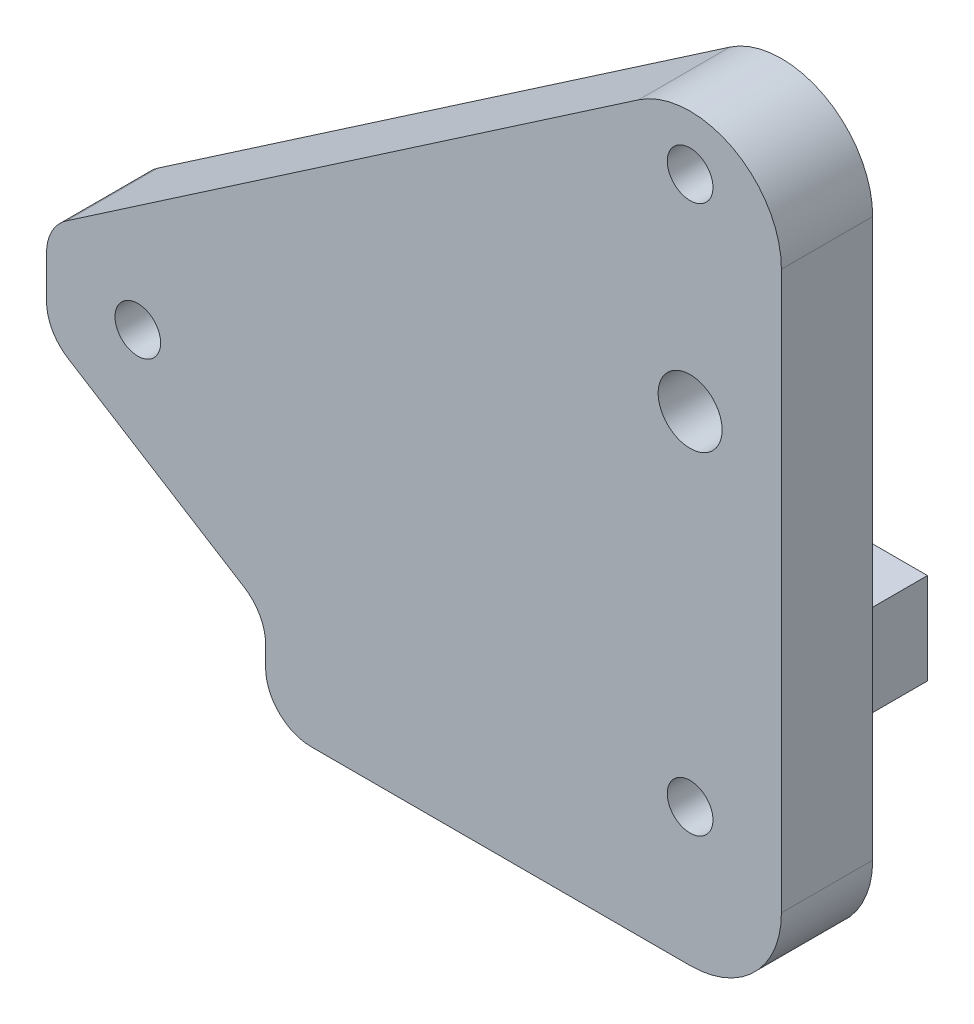
ISO-10303-21;
HEADER;
FILE_DESCRIPTION(('STEP AP214'),'2;1');
FILE_NAME('part.step','',(''),(''),'','','');
FILE_SCHEMA(('AUTOMOTIVE_DESIGN { 1 0 10303 214 1 1 1 1 }'));
ENDSEC;
DATA;
#1=APPLICATION_CONTEXT('core data for automotive mechanical design processes');
#2=APPLICATION_PROTOCOL_DEFINITION('international standard','automotive_design',2000,#1);
#3=PRODUCT_CONTEXT('',#1,'mechanical');
#4=PRODUCT('Part','Part','',(#3));
#5=PRODUCT_RELATED_PRODUCT_CATEGORY('part','',(#4));
#6=PRODUCT_DEFINITION_FORMATION('','',#4);
#7=PRODUCT_DEFINITION_CONTEXT('part definition',#1,'design');
#8=PRODUCT_DEFINITION('design','',#6,#7);
#9=PRODUCT_DEFINITION_SHAPE('','',#8);
#10=(LENGTH_UNIT() NAMED_UNIT(*) SI_UNIT(.MILLI.,.METRE.));
#11=(NAMED_UNIT(*) PLANE_ANGLE_UNIT() SI_UNIT($,.RADIAN.));
#12=(NAMED_UNIT(*) SI_UNIT($,.STERADIAN.) SOLID_ANGLE_UNIT());
#13=UNCERTAINTY_MEASURE_WITH_UNIT(LENGTH_MEASURE(1.E-05),#10,'distance_accuracy_value','');
#14=(GEOMETRIC_REPRESENTATION_CONTEXT(3) GLOBAL_UNCERTAINTY_ASSIGNED_CONTEXT((#13)) GLOBAL_UNIT_ASSIGNED_CONTEXT((#10,
#11,#12)) REPRESENTATION_CONTEXT('',''));
#15=CARTESIAN_POINT('',(0.,0.,0.));
#16=DIRECTION('',(0.,0.,1.));
#17=DIRECTION('',(1.,0.,0.));
#18=AXIS2_PLACEMENT_3D('',#15,#16,#17);
#19=CARTESIAN_POINT('',(-61.5,-45.3371408001229,10.));
#20=DIRECTION('',(0.,0.,1.));
#21=DIRECTION('',(1.,0.,0.));
#22=AXIS2_PLACEMENT_3D('',#19,#20,#21);
#23=PLANE('',#22);
#24=CARTESIAN_POINT('',(-9.99999999999999,0.,10.));
#25=DIRECTION('',(0.,0.,1.));
#26=DIRECTION('',(1.,0.,0.));
#27=AXIS2_PLACEMENT_3D('',#24,#25,#26);
#28=CIRCLE('',#27,3.5);
#29=CARTESIAN_POINT('',(-6.5,0.,10.));
#30=VERTEX_POINT('',#29);
#31=EDGE_CURVE('E344',#30,#30,#28,.T.);
#32=ORIENTED_EDGE('',*,*,#31,.F.);
#33=EDGE_LOOP('',(#32));
#34=FACE_BOUND('',#33,.T.);
#35=CARTESIAN_POINT('',(-70.5,-22.5,10.));
#36=DIRECTION('',(0.,0.,1.));
#37=DIRECTION('',(1.,0.,0.));
#38=AXIS2_PLACEMENT_3D('',#35,#36,#37);
#39=CIRCLE('',#38,2.5);
#40=CARTESIAN_POINT('',(-68.,-22.5,10.));
#41=VERTEX_POINT('',#40);
#42=EDGE_CURVE('E356',#41,#41,#39,.T.);
#43=ORIENTED_EDGE('',*,*,#42,.F.);
#44=EDGE_LOOP('',(#43));
#45=FACE_BOUND('',#44,.T.);
#46=CARTESIAN_POINT('',(-61.5,-45.3371408001229,10.));
#47=DIRECTION('',(0.,0.,1.));
#48=DIRECTION('',(1.,0.,0.));
#49=AXIS2_PLACEMENT_3D('',#46,#47,#48);
#50=CIRCLE('',#49,5.);
#51=CARTESIAN_POINT('',(-56.5,-45.337140800123,10.));
#52=VERTEX_POINT('',#51);
#53=CARTESIAN_POINT('',(-58.8500052999841,-41.0971492800975,10.));
#54=VERTEX_POINT('',#53);
#55=EDGE_CURVE('E362',#52,#54,#50,.T.);
#56=ORIENTED_EDGE('',*,*,#55,.F.);
#57=DIRECTION('',(0.,1.,0.));
#58=VECTOR('',#57,1.);
#59=CARTESIAN_POINT('',(-56.5,-47.5659025925876,10.));
#60=LINE('',#59,#58);
#61=CARTESIAN_POINT('',(-56.5,-47.5659025925876,10.));
#62=VERTEX_POINT('',#61);
#63=EDGE_CURVE('E392',#62,#52,#60,.T.);
#64=ORIENTED_EDGE('',*,*,#63,.F.);
#65=CARTESIAN_POINT('',(-51.5,-47.5659025925876,10.));
#66=DIRECTION('',(0.,0.,-1.));
#67=DIRECTION('',(-1.,0.,0.));
#68=AXIS2_PLACEMENT_3D('',#65,#66,#67);
#69=CIRCLE('',#68,5.);
#70=CARTESIAN_POINT('',(-51.5,-52.5659025925876,10.));
#71=VERTEX_POINT('',#70);
#72=EDGE_CURVE('E389',#71,#62,#69,.T.);
#73=ORIENTED_EDGE('',*,*,#72,.F.);
#74=DIRECTION('',(-1.,0.,0.));
#75=VECTOR('',#74,1.);
#76=CARTESIAN_POINT('',(-9.99999999999999,-52.5659025925875,10.));
#77=LINE('',#76,#75);
#78=CARTESIAN_POINT('',(-9.99999999999998,-52.5659025925875,10.));
#79=VERTEX_POINT('',#78);
#80=EDGE_CURVE('E386',#79,#71,#77,.T.);
#81=ORIENTED_EDGE('',*,*,#80,.F.);
#82=CARTESIAN_POINT('',(-9.99999999999999,-42.5659025925875,10.));
#83=DIRECTION('',(0.,0.,-1.));
#84=DIRECTION('',(-1.,0.,0.));
#85=AXIS2_PLACEMENT_3D('',#82,#83,#84);
#86=CIRCLE('',#85,10.);
#87=CARTESIAN_POINT('',(0.,-42.5659025925875,10.));
#88=VERTEX_POINT('',#87);
#89=EDGE_CURVE('E383',#88,#79,#86,.T.);
#90=ORIENTED_EDGE('',*,*,#89,.F.);
#91=DIRECTION('',(0.,-1.,0.));
#92=VECTOR('',#91,1.);
#93=CARTESIAN_POINT('',(0.,18.4906350894,10.));
#94=LINE('',#93,#92);
#95=CARTESIAN_POINT('',(0.,18.4906350894,10.));
#96=VERTEX_POINT('',#95);
#97=EDGE_CURVE('E380',#96,#88,#94,.T.);
#98=ORIENTED_EDGE('',*,*,#97,.F.);
#99=CARTESIAN_POINT('',(-10.,18.4906350894,10.));
#100=DIRECTION('',(0.,0.,1.));
#101=DIRECTION('',(1.,0.,0.));
#102=AXIS2_PLACEMENT_3D('',#99,#100,#101);
#103=CIRCLE('',#102,10.);
#104=CARTESIAN_POINT('',(-15.6413223653245,26.7474796422839,10.));
#105=VERTEX_POINT('',#104);
#106=EDGE_CURVE('E378',#96,#105,#103,.T.);
#107=ORIENTED_EDGE('',*,*,#106,.T.);
#108=DIRECTION('',(-0.825684455288399,-0.564132236532446,0.));
#109=VECTOR('',#108,1.);
#110=CARTESIAN_POINT('',(-15.6413223653245,26.7474796422839,10.));
#111=LINE('',#110,#109);
#112=CARTESIAN_POINT('',(-78.3206611826622,-16.0769133385059,10.));
#113=VERTEX_POINT('',#112);
#114=EDGE_CURVE('E376',#105,#113,#111,.T.);
#115=ORIENTED_EDGE('',*,*,#114,.T.);
#116=CARTESIAN_POINT('',(-75.5,-20.2053356149478,10.));
#117=DIRECTION('',(0.,0.,-1.));
#118=DIRECTION('',(-1.,0.,0.));
#119=AXIS2_PLACEMENT_3D('',#116,#117,#118);
#120=CIRCLE('',#119,4.99999999999998);
#121=CARTESIAN_POINT('',(-80.5,-20.2053356149478,10.));
#122=VERTEX_POINT('',#121);
#123=EDGE_CURVE('E373',#122,#113,#120,.T.);
#124=ORIENTED_EDGE('',*,*,#123,.F.);
#125=DIRECTION('',(0.,-1.,0.));
#126=VECTOR('',#125,1.);
#127=CARTESIAN_POINT('',(-80.5,-20.2053356149478,10.));
#128=LINE('',#127,#126);
#129=CARTESIAN_POINT('',(-80.5,-24.7946643850522,10.));
#130=VERTEX_POINT('',#129);
#131=EDGE_CURVE('E371',#122,#130,#128,.T.);
#132=ORIENTED_EDGE('',*,*,#131,.T.);
#133=CARTESIAN_POINT('',(-75.5,-24.7946643850522,10.));
#134=DIRECTION('',(0.,0.,1.));
#135=DIRECTION('',(1.,0.,0.));
#136=AXIS2_PLACEMENT_3D('',#133,#134,#135);
#137=CIRCLE('',#136,5.);
#138=CARTESIAN_POINT('',(-78.1499947000159,-29.0346559050776,10.));
#139=VERTEX_POINT('',#138);
#140=EDGE_CURVE('E369',#130,#139,#137,.T.);
#141=ORIENTED_EDGE('',*,*,#140,.T.);
#142=DIRECTION('',(-0.847998304005088,0.529998940003179,0.));
#143=VECTOR('',#142,1.);
#144=CARTESIAN_POINT('',(-58.8500052999841,-41.0971492800975,10.));
#145=LINE('',#144,#143);
#146=EDGE_CURVE('E365',#54,#139,#145,.T.);
#147=ORIENTED_EDGE('',*,*,#146,.F.);
#148=EDGE_LOOP('',(#56,#64,#73,#81,#90,#98,#107,#115,#124,#132,#141,#147));
#149=FACE_BOUND('',#148,.T.);
#150=CARTESIAN_POINT('',(-9.99999999999999,-37.5,10.));
#151=DIRECTION('',(0.,0.,1.));
#152=DIRECTION('',(1.,0.,0.));
#153=AXIS2_PLACEMENT_3D('',#150,#151,#152);
#154=CIRCLE('',#153,2.5);
#155=CARTESIAN_POINT('',(-7.49999999999999,-37.5,10.));
#156=VERTEX_POINT('',#155);
#157=EDGE_CURVE('E350',#156,#156,#154,.T.);
#158=ORIENTED_EDGE('',*,*,#157,.F.);
#159=EDGE_LOOP('',(#158));
#160=FACE_BOUND('',#159,.T.);
#161=CARTESIAN_POINT('',(-9.99999999999999,22.5,10.));
#162=DIRECTION('',(0.,0.,1.));
#163=DIRECTION('',(1.,0.,0.));
#164=AXIS2_PLACEMENT_3D('',#161,#162,#163);
#165=CIRCLE('',#164,2.5);
#166=CARTESIAN_POINT('',(-7.49999999999999,22.5,10.));
#167=VERTEX_POINT('',#166);
#168=EDGE_CURVE('E338',#167,#167,#165,.T.);
#169=ORIENTED_EDGE('',*,*,#168,.F.);
#170=EDGE_LOOP('',(#169));
#171=FACE_BOUND('',#170,.T.);
#172=ADVANCED_FACE('F189',(#34,#45,#149,#160,#171),#23,.T.);
#173=CARTESIAN_POINT('',(-61.5,-45.3371408001229,0.));
#174=DIRECTION('',(0.,0.,1.));
#175=DIRECTION('',(1.,0.,0.));
#176=AXIS2_PLACEMENT_3D('',#173,#174,#175);
#177=PLANE('',#176);
#178=DIRECTION('',(-1.,0.,0.));
#179=VECTOR('',#178,1.);
#180=CARTESIAN_POINT('',(-9.99999999999999,-52.5659025925875,0.));
#181=LINE('',#180,#179);
#182=CARTESIAN_POINT('',(-9.99999999999998,-52.5659025925875,0.));
#183=VERTEX_POINT('',#182);
#184=CARTESIAN_POINT('',(-24.,-52.5659025925875,0.));
#185=VERTEX_POINT('',#184);
#186=EDGE_CURVE('E366',#183,#185,#181,.T.);
#187=ORIENTED_EDGE('',*,*,#186,.T.);
#188=DIRECTION('',(0.,1.,0.));
#189=VECTOR('',#188,1.);
#190=CARTESIAN_POINT('',(-24.,-52.5659025925875,0.));
#191=LINE('',#190,#189);
#192=CARTESIAN_POINT('',(-24.,-42.5659025925875,0.));
#193=VERTEX_POINT('',#192);
#194=EDGE_CURVE('E206',#185,#193,#191,.T.);
#195=ORIENTED_EDGE('',*,*,#194,.T.);
#196=DIRECTION('',(-1.,0.,0.));
#197=VECTOR('',#196,1.);
#198=CARTESIAN_POINT('',(-24.,-42.5659025925875,0.));
#199=LINE('',#198,#197);
#200=CARTESIAN_POINT('',(-56.5,-42.5659025925875,0.));
#201=VERTEX_POINT('',#200);
#202=EDGE_CURVE('E211',#193,#201,#199,.T.);
#203=ORIENTED_EDGE('',*,*,#202,.T.);
#204=DIRECTION('',(0.,-1.,0.));
#205=VECTOR('',#204,1.);
#206=CARTESIAN_POINT('',(-56.5,-47.5659025925876,0.));
#207=LINE('',#206,#205);
#208=CARTESIAN_POINT('',(-56.5,-45.3371408001229,0.));
#209=VERTEX_POINT('',#208);
#210=EDGE_CURVE('E320',#201,#209,#207,.T.);
#211=ORIENTED_EDGE('',*,*,#210,.T.);
#212=CARTESIAN_POINT('',(-61.5,-45.3371408001229,0.));
#213=DIRECTION('',(0.,0.,1.));
#214=DIRECTION('',(1.,0.,0.));
#215=AXIS2_PLACEMENT_3D('',#212,#213,#214);
#216=CIRCLE('',#215,5.);
#217=CARTESIAN_POINT('',(-58.8500052999841,-41.0971492800975,0.));
#218=VERTEX_POINT('',#217);
#219=EDGE_CURVE('E359',#209,#218,#216,.T.);
#220=ORIENTED_EDGE('',*,*,#219,.T.);
#221=DIRECTION('',(-0.847998304005088,0.529998940003179,0.));
#222=VECTOR('',#221,1.);
#223=CARTESIAN_POINT('',(-58.8500052999841,-41.0971492800975,0.));
#224=LINE('',#223,#222);
#225=CARTESIAN_POINT('',(-78.1499947000159,-29.0346559050776,0.));
#226=VERTEX_POINT('',#225);
#227=EDGE_CURVE('E397',#218,#226,#224,.T.);
#228=ORIENTED_EDGE('',*,*,#227,.T.);
#229=CARTESIAN_POINT('',(-75.5,-24.7946643850522,0.));
#230=DIRECTION('',(0.,0.,1.));
#231=DIRECTION('',(1.,0.,0.));
#232=AXIS2_PLACEMENT_3D('',#229,#230,#231);
#233=CIRCLE('',#232,5.);
#234=CARTESIAN_POINT('',(-80.5,-24.7946643850522,0.));
#235=VERTEX_POINT('',#234);
#236=EDGE_CURVE('E400',#235,#226,#233,.T.);
#237=ORIENTED_EDGE('',*,*,#236,.F.);
#238=DIRECTION('',(0.,-1.,0.));
#239=VECTOR('',#238,1.);
#240=CARTESIAN_POINT('',(-80.5,-20.2053356149478,0.));
#241=LINE('',#240,#239);
#242=CARTESIAN_POINT('',(-80.5,-20.2053356149478,0.));
#243=VERTEX_POINT('',#242);
#244=EDGE_CURVE('E403',#243,#235,#241,.T.);
#245=ORIENTED_EDGE('',*,*,#244,.F.);
#246=CARTESIAN_POINT('',(-75.5,-20.2053356149478,0.));
#247=DIRECTION('',(0.,0.,-1.));
#248=DIRECTION('',(-1.,0.,0.));
#249=AXIS2_PLACEMENT_3D('',#246,#247,#248);
#250=CIRCLE('',#249,4.99999999999998);
#251=CARTESIAN_POINT('',(-78.3206611826622,-16.0769133385059,0.));
#252=VERTEX_POINT('',#251);
#253=EDGE_CURVE('E405',#243,#252,#250,.T.);
#254=ORIENTED_EDGE('',*,*,#253,.T.);
#255=DIRECTION('',(-0.825684455288399,-0.564132236532446,0.));
#256=VECTOR('',#255,1.);
#257=CARTESIAN_POINT('',(-15.6413223653245,26.7474796422839,0.));
#258=LINE('',#257,#256);
#259=CARTESIAN_POINT('',(-15.6413223653245,26.7474796422839,0.));
#260=VERTEX_POINT('',#259);
#261=EDGE_CURVE('E408',#260,#252,#258,.T.);
#262=ORIENTED_EDGE('',*,*,#261,.F.);
#263=CARTESIAN_POINT('',(-10.,18.4906350894,0.));
#264=DIRECTION('',(0.,0.,1.));
#265=DIRECTION('',(1.,0.,0.));
#266=AXIS2_PLACEMENT_3D('',#263,#264,#265);
#267=CIRCLE('',#266,10.);
#268=CARTESIAN_POINT('',(0.,18.4906350894,0.));
#269=VERTEX_POINT('',#268);
#270=EDGE_CURVE('E411',#269,#260,#267,.T.);
#271=ORIENTED_EDGE('',*,*,#270,.F.);
#272=DIRECTION('',(0.,-1.,0.));
#273=VECTOR('',#272,1.);
#274=CARTESIAN_POINT('',(0.,18.4906350894,0.));
#275=LINE('',#274,#273);
#276=CARTESIAN_POINT('',(0.,-42.5659025925875,0.));
#277=VERTEX_POINT('',#276);
#278=EDGE_CURVE('E413',#269,#277,#275,.T.);
#279=ORIENTED_EDGE('',*,*,#278,.T.);
#280=CARTESIAN_POINT('',(-9.99999999999999,-42.5659025925875,0.));
#281=DIRECTION('',(0.,0.,-1.));
#282=DIRECTION('',(-1.,0.,0.));
#283=AXIS2_PLACEMENT_3D('',#280,#281,#282);
#284=CIRCLE('',#283,10.);
#285=EDGE_CURVE('E416',#277,#183,#284,.T.);
#286=ORIENTED_EDGE('',*,*,#285,.T.);
#287=EDGE_LOOP('',(#187,#195,#203,#211,#220,#228,#237,#245,#254,#262,#271,#279,#286));
#288=FACE_BOUND('',#287,.T.);
#289=CARTESIAN_POINT('',(-70.5,-22.5,0.));
#290=DIRECTION('',(0.,0.,1.));
#291=DIRECTION('',(1.,0.,0.));
#292=AXIS2_PLACEMENT_3D('',#289,#290,#291);
#293=CIRCLE('',#292,2.5);
#294=CARTESIAN_POINT('',(-68.,-22.5,0.));
#295=VERTEX_POINT('',#294);
#296=EDGE_CURVE('E353',#295,#295,#293,.T.);
#297=ORIENTED_EDGE('',*,*,#296,.T.);
#298=EDGE_LOOP('',(#297));
#299=FACE_BOUND('',#298,.T.);
#300=CARTESIAN_POINT('',(-9.99999999999999,-37.5,0.));
#301=DIRECTION('',(0.,0.,1.));
#302=DIRECTION('',(1.,0.,0.));
#303=AXIS2_PLACEMENT_3D('',#300,#301,#302);
#304=CIRCLE('',#303,2.5);
#305=CARTESIAN_POINT('',(-7.49999999999999,-37.5,0.));
#306=VERTEX_POINT('',#305);
#307=EDGE_CURVE('E347',#306,#306,#304,.T.);
#308=ORIENTED_EDGE('',*,*,#307,.T.);
#309=EDGE_LOOP('',(#308));
#310=FACE_BOUND('',#309,.T.);
#311=CARTESIAN_POINT('',(-9.99999999999999,0.,0.));
#312=DIRECTION('',(0.,0.,1.));
#313=DIRECTION('',(1.,0.,0.));
#314=AXIS2_PLACEMENT_3D('',#311,#312,#313);
#315=CIRCLE('',#314,3.5);
#316=CARTESIAN_POINT('',(-6.5,0.,0.));
#317=VERTEX_POINT('',#316);
#318=EDGE_CURVE('E341',#317,#317,#315,.T.);
#319=ORIENTED_EDGE('',*,*,#318,.T.);
#320=EDGE_LOOP('',(#319));
#321=FACE_BOUND('',#320,.T.);
#322=CARTESIAN_POINT('',(-9.99999999999999,22.5,0.));
#323=DIRECTION('',(0.,0.,1.));
#324=DIRECTION('',(1.,0.,0.));
#325=AXIS2_PLACEMENT_3D('',#322,#323,#324);
#326=CIRCLE('',#325,2.5);
#327=CARTESIAN_POINT('',(-7.49999999999999,22.5,0.));
#328=VERTEX_POINT('',#327);
#329=EDGE_CURVE('E336',#328,#328,#326,.T.);
#330=ORIENTED_EDGE('',*,*,#329,.T.);
#331=EDGE_LOOP('',(#330));
#332=FACE_BOUND('',#331,.T.);
#333=ADVANCED_FACE('F447',(#288,#299,#310,#321,#332),#177,.F.);
#334=CARTESIAN_POINT('',(-61.5,-45.3371408001229,10.));
#335=DIRECTION('',(0.,0.,-1.));
#336=DIRECTION('',(-1.,0.,0.));
#337=AXIS2_PLACEMENT_3D('',#334,#335,#336);
#338=CYLINDRICAL_SURFACE('',#337,5.);
#339=ORIENTED_EDGE('',*,*,#219,.F.);
#340=DIRECTION('',(0.,0.,-1.));
#341=VECTOR('',#340,1.);
#342=CARTESIAN_POINT('',(-56.5,-45.337140800123,10.));
#343=LINE('',#342,#341);
#344=EDGE_CURVE('E12',#52,#209,#343,.T.);
#345=ORIENTED_EDGE('',*,*,#344,.F.);
#346=ORIENTED_EDGE('',*,*,#55,.T.);
#347=DIRECTION('',(0.,0.,-1.));
#348=VECTOR('',#347,1.);
#349=CARTESIAN_POINT('',(-58.8500052999841,-41.0971492800975,10.));
#350=LINE('',#349,#348);
#351=EDGE_CURVE('E193',#54,#218,#350,.T.);
#352=ORIENTED_EDGE('',*,*,#351,.T.);
#353=EDGE_LOOP('',(#339,#345,#346,#352));
#354=FACE_BOUND('',#353,.T.);
#355=ADVANCED_FACE('F191',(#354),#338,.F.);
#356=CARTESIAN_POINT('',(-56.5,-47.5659025925876,10.));
#357=DIRECTION('',(-1.,0.,0.));
#358=DIRECTION('',(0.,-1.,0.));
#359=AXIS2_PLACEMENT_3D('',#356,#357,#358);
#360=PLANE('',#359);
#361=ORIENTED_EDGE('',*,*,#344,.T.);
#362=ORIENTED_EDGE('',*,*,#210,.F.);
#363=DIRECTION('',(0.,0.,1.));
#364=VECTOR('',#363,1.);
#365=CARTESIAN_POINT('',(-56.5,-42.5659025925875,-30.));
#366=LINE('',#365,#364);
#367=CARTESIAN_POINT('',(-56.5,-42.5659025925875,-30.));
#368=VERTEX_POINT('',#367);
#369=EDGE_CURVE('E303',#368,#201,#366,.T.);
#370=ORIENTED_EDGE('',*,*,#369,.F.);
#371=DIRECTION('',(0.,-1.,0.));
#372=VECTOR('',#371,1.);
#373=CARTESIAN_POINT('',(-56.5,-47.5659025925876,-30.));
#374=LINE('',#373,#372);
#375=CARTESIAN_POINT('',(-56.5,-47.5659025925876,-30.));
#376=VERTEX_POINT('',#375);
#377=EDGE_CURVE('E315',#368,#376,#374,.T.);
#378=ORIENTED_EDGE('',*,*,#377,.T.);
#379=DIRECTION('',(0.,0.,-1.));
#380=VECTOR('',#379,1.);
#381=CARTESIAN_POINT('',(-56.5,-47.5659025925876,10.));
#382=LINE('',#381,#380);
#383=EDGE_CURVE('E198',#62,#376,#382,.T.);
#384=ORIENTED_EDGE('',*,*,#383,.F.);
#385=ORIENTED_EDGE('',*,*,#63,.T.);
#386=EDGE_LOOP('',(#361,#362,#370,#378,#384,#385));
#387=FACE_BOUND('',#386,.T.);
#388=ADVANCED_FACE('F451',(#387),#360,.T.);
#389=CARTESIAN_POINT('',(-51.5,-47.5659025925876,10.));
#390=DIRECTION('',(0.,0.,-1.));
#391=DIRECTION('',(-1.,0.,0.));
#392=AXIS2_PLACEMENT_3D('',#389,#390,#391);
#393=CYLINDRICAL_SURFACE('',#392,5.);
#394=ORIENTED_EDGE('',*,*,#383,.T.);
#395=CARTESIAN_POINT('',(-51.5,-47.5659025925876,-30.));
#396=DIRECTION('',(0.,0.,1.));
#397=DIRECTION('',(1.,0.,0.));
#398=AXIS2_PLACEMENT_3D('',#395,#396,#397);
#399=CIRCLE('',#398,5.);
#400=CARTESIAN_POINT('',(-51.5,-52.5659025925876,-30.));
#401=VERTEX_POINT('',#400);
#402=EDGE_CURVE('E328',#376,#401,#399,.T.);
#403=ORIENTED_EDGE('',*,*,#402,.T.);
#404=DIRECTION('',(0.,0.,-1.));
#405=VECTOR('',#404,1.);
#406=CARTESIAN_POINT('',(-51.5,-52.5659025925876,10.));
#407=LINE('',#406,#405);
#408=EDGE_CURVE('E421',#71,#401,#407,.T.);
#409=ORIENTED_EDGE('',*,*,#408,.F.);
#410=ORIENTED_EDGE('',*,*,#72,.T.);
#411=EDGE_LOOP('',(#394,#403,#409,#410));
#412=FACE_BOUND('',#411,.T.);
#413=ADVANCED_FACE('F488',(#412),#393,.T.);
#414=CARTESIAN_POINT('',(-9.99999999999999,-52.5659025925875,10.));
#415=DIRECTION('',(0.,-1.,0.));
#416=DIRECTION('',(1.,0.,0.));
#417=AXIS2_PLACEMENT_3D('',#414,#415,#416);
#418=PLANE('',#417);
#419=CARTESIAN_POINT('',(-40.25,-52.5659025925876,-23.));
#420=DIRECTION('',(0.,1.,0.));
#421=DIRECTION('',(-1.,0.,0.));
#422=AXIS2_PLACEMENT_3D('',#419,#420,#421);
#423=CIRCLE('',#422,1.75);
#424=CARTESIAN_POINT('',(-42.,-52.5659025925876,-23.));
#425=VERTEX_POINT('',#424);
#426=EDGE_CURVE('E718',#425,#425,#423,.T.);
#427=ORIENTED_EDGE('',*,*,#426,.T.);
#428=EDGE_LOOP('',(#427));
#429=FACE_BOUND('',#428,.T.);
#430=CARTESIAN_POINT('',(-48.25,-52.5659025925876,-15.));
#431=DIRECTION('',(0.,1.,0.));
#432=DIRECTION('',(-1.,0.,0.));
#433=AXIS2_PLACEMENT_3D('',#430,#431,#432);
#434=CIRCLE('',#433,1.75);
#435=CARTESIAN_POINT('',(-50.,-52.5659025925876,-15.));
#436=VERTEX_POINT('',#435);
#437=EDGE_CURVE('E732',#436,#436,#434,.T.);
#438=ORIENTED_EDGE('',*,*,#437,.T.);
#439=EDGE_LOOP('',(#438));
#440=FACE_BOUND('',#439,.T.);
#441=CARTESIAN_POINT('',(-32.25,-52.5659025925876,-15.));
#442=DIRECTION('',(0.,1.,0.));
#443=DIRECTION('',(-1.,0.,0.));
#444=AXIS2_PLACEMENT_3D('',#441,#442,#443);
#445=CIRCLE('',#444,1.75);
#446=CARTESIAN_POINT('',(-34.,-52.5659025925876,-15.));
#447=VERTEX_POINT('',#446);
#448=EDGE_CURVE('E744',#447,#447,#445,.T.);
#449=ORIENTED_EDGE('',*,*,#448,.T.);
#450=EDGE_LOOP('',(#449));
#451=FACE_BOUND('',#450,.T.);
#452=CARTESIAN_POINT('',(-40.25,-52.5659025925876,-7.00000000000001));
#453=DIRECTION('',(0.,1.,0.));
#454=DIRECTION('',(-1.,0.,0.));
#455=AXIS2_PLACEMENT_3D('',#452,#453,#454);
#456=CIRCLE('',#455,1.75);
#457=CARTESIAN_POINT('',(-42.,-52.5659025925876,-7.00000000000001));
#458=VERTEX_POINT('',#457);
#459=EDGE_CURVE('E727',#458,#458,#456,.T.);
#460=ORIENTED_EDGE('',*,*,#459,.T.);
#461=EDGE_LOOP('',(#460));
#462=FACE_BOUND('',#461,.T.);
#463=CARTESIAN_POINT('',(-40.25,-52.5659025925876,-15.));
#464=DIRECTION('',(0.,1.,0.));
#465=DIRECTION('',(-1.,0.,0.));
#466=AXIS2_PLACEMENT_3D('',#463,#464,#465);
#467=CIRCLE('',#466,5.25);
#468=CARTESIAN_POINT('',(-45.5,-52.5659025925876,-15.));
#469=VERTEX_POINT('',#468);
#470=EDGE_CURVE('E333',#469,#469,#467,.T.);
#471=ORIENTED_EDGE('',*,*,#470,.T.);
#472=EDGE_LOOP('',(#471));
#473=FACE_BOUND('',#472,.T.);
#474=ORIENTED_EDGE('',*,*,#186,.F.);
#475=DIRECTION('',(0.,0.,-1.));
#476=VECTOR('',#475,1.);
#477=CARTESIAN_POINT('',(-9.99999999999998,-52.5659025925875,10.));
#478=LINE('',#477,#476);
#479=EDGE_CURVE('E423',#79,#183,#478,.T.);
#480=ORIENTED_EDGE('',*,*,#479,.F.);
#481=ORIENTED_EDGE('',*,*,#80,.T.);
#482=ORIENTED_EDGE('',*,*,#408,.T.);
#483=DIRECTION('',(1.,0.,0.));
#484=VECTOR('',#483,1.);
#485=CARTESIAN_POINT('',(-24.,-52.5659025925875,-30.));
#486=LINE('',#485,#484);
#487=CARTESIAN_POINT('',(-24.,-52.5659025925875,-30.));
#488=VERTEX_POINT('',#487);
#489=EDGE_CURVE('E304',#401,#488,#486,.T.);
#490=ORIENTED_EDGE('',*,*,#489,.T.);
#491=DIRECTION('',(0.,0.,1.));
#492=VECTOR('',#491,1.);
#493=CARTESIAN_POINT('',(-24.,-52.5659025925875,-30.));
#494=LINE('',#493,#492);
#495=EDGE_CURVE('E319',#488,#185,#494,.T.);
#496=ORIENTED_EDGE('',*,*,#495,.T.);
#497=EDGE_LOOP('',(#474,#480,#481,#482,#490,#496));
#498=FACE_BOUND('',#497,.T.);
#499=ADVANCED_FACE('F486',(#429,#440,#451,#462,#473,#498),#418,.T.);
#500=CARTESIAN_POINT('',(-9.99999999999999,-42.5659025925875,10.));
#501=DIRECTION('',(0.,0.,-1.));
#502=DIRECTION('',(-1.,0.,0.));
#503=AXIS2_PLACEMENT_3D('',#500,#501,#502);
#504=CYLINDRICAL_SURFACE('',#503,10.);
#505=ORIENTED_EDGE('',*,*,#285,.F.);
#506=DIRECTION('',(0.,0.,-1.));
#507=VECTOR('',#506,1.);
#508=CARTESIAN_POINT('',(0.,-42.5659025925875,10.));
#509=LINE('',#508,#507);
#510=EDGE_CURVE('E425',#88,#277,#509,.T.);
#511=ORIENTED_EDGE('',*,*,#510,.F.);
#512=ORIENTED_EDGE('',*,*,#89,.T.);
#513=ORIENTED_EDGE('',*,*,#479,.T.);
#514=EDGE_LOOP('',(#505,#511,#512,#513));
#515=FACE_BOUND('',#514,.T.);
#516=ADVANCED_FACE('F483',(#515),#504,.T.);
#517=CARTESIAN_POINT('',(0.,18.4906350894,10.));
#518=DIRECTION('',(1.,0.,0.));
#519=DIRECTION('',(0.,1.,0.));
#520=AXIS2_PLACEMENT_3D('',#517,#518,#519);
#521=PLANE('',#520);
#522=ORIENTED_EDGE('',*,*,#278,.F.);
#523=DIRECTION('',(0.,0.,-1.));
#524=VECTOR('',#523,1.);
#525=CARTESIAN_POINT('',(0.,18.4906350894,10.));
#526=LINE('',#525,#524);
#527=EDGE_CURVE('E427',#96,#269,#526,.T.);
#528=ORIENTED_EDGE('',*,*,#527,.F.);
#529=ORIENTED_EDGE('',*,*,#97,.T.);
#530=ORIENTED_EDGE('',*,*,#510,.T.);
#531=EDGE_LOOP('',(#522,#528,#529,#530));
#532=FACE_BOUND('',#531,.T.);
#533=ADVANCED_FACE('F477',(#532),#521,.T.);
#534=CARTESIAN_POINT('',(-10.,18.4906350894,10.));
#535=DIRECTION('',(0.,0.,-1.));
#536=DIRECTION('',(-1.,0.,0.));
#537=AXIS2_PLACEMENT_3D('',#534,#535,#536);
#538=CYLINDRICAL_SURFACE('',#537,10.);
#539=ORIENTED_EDGE('',*,*,#270,.T.);
#540=DIRECTION('',(0.,0.,-1.));
#541=VECTOR('',#540,1.);
#542=CARTESIAN_POINT('',(-15.6413223653245,26.7474796422839,10.));
#543=LINE('',#542,#541);
#544=EDGE_CURVE('E429',#105,#260,#543,.T.);
#545=ORIENTED_EDGE('',*,*,#544,.F.);
#546=ORIENTED_EDGE('',*,*,#106,.F.);
#547=ORIENTED_EDGE('',*,*,#527,.T.);
#548=EDGE_LOOP('',(#539,#545,#546,#547));
#549=FACE_BOUND('',#548,.T.);
#550=ADVANCED_FACE('F490',(#549),#538,.T.);
#551=CARTESIAN_POINT('',(-15.6413223653245,26.7474796422839,10.));
#552=DIRECTION('',(0.564132236532446,-0.825684455288399,0.));
#553=DIRECTION('',(0.825684455288399,0.564132236532446,0.));
#554=AXIS2_PLACEMENT_3D('',#551,#552,#553);
#555=PLANE('',#554);
#556=ORIENTED_EDGE('',*,*,#261,.T.);
#557=DIRECTION('',(0.,0.,-1.));
#558=VECTOR('',#557,1.);
#559=CARTESIAN_POINT('',(-78.3206611826622,-16.0769133385059,10.));
#560=LINE('',#559,#558);
#561=EDGE_CURVE('E432',#113,#252,#560,.T.);
#562=ORIENTED_EDGE('',*,*,#561,.F.);
#563=ORIENTED_EDGE('',*,*,#114,.F.);
#564=ORIENTED_EDGE('',*,*,#544,.T.);
#565=EDGE_LOOP('',(#556,#562,#563,#564));
#566=FACE_BOUND('',#565,.T.);
#567=ADVANCED_FACE('F471',(#566),#555,.F.);
#568=CARTESIAN_POINT('',(-75.5,-20.2053356149478,10.));
#569=DIRECTION('',(0.,0.,-1.));
#570=DIRECTION('',(-1.,0.,0.));
#571=AXIS2_PLACEMENT_3D('',#568,#569,#570);
#572=CYLINDRICAL_SURFACE('',#571,4.99999999999998);
#573=ORIENTED_EDGE('',*,*,#253,.F.);
#574=DIRECTION('',(0.,0.,-1.));
#575=VECTOR('',#574,1.);
#576=CARTESIAN_POINT('',(-80.5,-20.2053356149478,10.));
#577=LINE('',#576,#575);
#578=EDGE_CURVE('E434',#122,#243,#577,.T.);
#579=ORIENTED_EDGE('',*,*,#578,.F.);
#580=ORIENTED_EDGE('',*,*,#123,.T.);
#581=ORIENTED_EDGE('',*,*,#561,.T.);
#582=EDGE_LOOP('',(#573,#579,#580,#581));
#583=FACE_BOUND('',#582,.T.);
#584=ADVANCED_FACE('F467',(#583),#572,.T.);
#585=CARTESIAN_POINT('',(-80.5,-20.2053356149478,10.));
#586=DIRECTION('',(1.,0.,0.));
#587=DIRECTION('',(0.,0.,-1.));
#588=AXIS2_PLACEMENT_3D('',#585,#586,#587);
#589=PLANE('',#588);
#590=ORIENTED_EDGE('',*,*,#244,.T.);
#591=DIRECTION('',(0.,0.,-1.));
#592=VECTOR('',#591,1.);
#593=CARTESIAN_POINT('',(-80.5,-24.7946643850522,10.));
#594=LINE('',#593,#592);
#595=EDGE_CURVE('E436',#130,#235,#594,.T.);
#596=ORIENTED_EDGE('',*,*,#595,.F.);
#597=ORIENTED_EDGE('',*,*,#131,.F.);
#598=ORIENTED_EDGE('',*,*,#578,.T.);
#599=EDGE_LOOP('',(#590,#596,#597,#598));
#600=FACE_BOUND('',#599,.T.);
#601=ADVANCED_FACE('F548',(#600),#589,.F.);
#602=CARTESIAN_POINT('',(-75.5,-24.7946643850522,10.));
#603=DIRECTION('',(0.,0.,-1.));
#604=DIRECTION('',(-1.,0.,0.));
#605=AXIS2_PLACEMENT_3D('',#602,#603,#604);
#606=CYLINDRICAL_SURFACE('',#605,5.);
#607=ORIENTED_EDGE('',*,*,#236,.T.);
#608=DIRECTION('',(0.,0.,-1.));
#609=VECTOR('',#608,1.);
#610=CARTESIAN_POINT('',(-78.1499947000159,-29.0346559050776,10.));
#611=LINE('',#610,#609);
#612=EDGE_CURVE('E438',#139,#226,#611,.T.);
#613=ORIENTED_EDGE('',*,*,#612,.F.);
#614=ORIENTED_EDGE('',*,*,#140,.F.);
#615=ORIENTED_EDGE('',*,*,#595,.T.);
#616=EDGE_LOOP('',(#607,#613,#614,#615));
#617=FACE_BOUND('',#616,.T.);
#618=ADVANCED_FACE('F461',(#617),#606,.T.);
#619=CARTESIAN_POINT('',(-58.8500052999841,-41.0971492800975,10.));
#620=DIRECTION('',(-0.529998940003179,-0.847998304005088,0.));
#621=DIRECTION('',(0.847998304005088,-0.529998940003179,0.));
#622=AXIS2_PLACEMENT_3D('',#619,#620,#621);
#623=PLANE('',#622);
#624=ORIENTED_EDGE('',*,*,#227,.F.);
#625=ORIENTED_EDGE('',*,*,#351,.F.);
#626=ORIENTED_EDGE('',*,*,#146,.T.);
#627=ORIENTED_EDGE('',*,*,#612,.T.);
#628=EDGE_LOOP('',(#624,#625,#626,#627));
#629=FACE_BOUND('',#628,.T.);
#630=ADVANCED_FACE('F445',(#629),#623,.T.);
#631=CARTESIAN_POINT('',(-70.5,-22.5,10.));
#632=DIRECTION('',(0.,0.,-1.));
#633=DIRECTION('',(-1.,0.,0.));
#634=AXIS2_PLACEMENT_3D('',#631,#632,#633);
#635=CYLINDRICAL_SURFACE('',#634,2.5);
#636=ORIENTED_EDGE('',*,*,#42,.T.);
#637=EDGE_LOOP('',(#636));
#638=FACE_BOUND('',#637,.T.);
#639=ORIENTED_EDGE('',*,*,#296,.F.);
#640=EDGE_LOOP('',(#639));
#641=FACE_BOUND('',#640,.T.);
#642=ADVANCED_FACE('F509',(#638,#641),#635,.F.);
#643=CARTESIAN_POINT('',(-9.99999999999999,-37.5,10.));
#644=DIRECTION('',(0.,0.,-1.));
#645=DIRECTION('',(-1.,0.,0.));
#646=AXIS2_PLACEMENT_3D('',#643,#644,#645);
#647=CYLINDRICAL_SURFACE('',#646,2.5);
#648=ORIENTED_EDGE('',*,*,#157,.T.);
#649=EDGE_LOOP('',(#648));
#650=FACE_BOUND('',#649,.T.);
#651=ORIENTED_EDGE('',*,*,#307,.F.);
#652=EDGE_LOOP('',(#651));
#653=FACE_BOUND('',#652,.T.);
#654=ADVANCED_FACE('F580',(#650,#653),#647,.F.);
#655=CARTESIAN_POINT('',(-9.99999999999999,0.,10.));
#656=DIRECTION('',(0.,0.,-1.));
#657=DIRECTION('',(-1.,0.,0.));
#658=AXIS2_PLACEMENT_3D('',#655,#656,#657);
#659=CYLINDRICAL_SURFACE('',#658,3.5);
#660=ORIENTED_EDGE('',*,*,#31,.T.);
#661=EDGE_LOOP('',(#660));
#662=FACE_BOUND('',#661,.T.);
#663=ORIENTED_EDGE('',*,*,#318,.F.);
#664=EDGE_LOOP('',(#663));
#665=FACE_BOUND('',#664,.T.);
#666=ADVANCED_FACE('F589',(#662,#665),#659,.F.);
#667=CARTESIAN_POINT('',(-9.99999999999999,22.5,10.));
#668=DIRECTION('',(0.,0.,-1.));
#669=DIRECTION('',(-1.,0.,0.));
#670=AXIS2_PLACEMENT_3D('',#667,#668,#669);
#671=CYLINDRICAL_SURFACE('',#670,2.5);
#672=ORIENTED_EDGE('',*,*,#168,.T.);
#673=EDGE_LOOP('',(#672));
#674=FACE_BOUND('',#673,.T.);
#675=ORIENTED_EDGE('',*,*,#329,.F.);
#676=EDGE_LOOP('',(#675));
#677=FACE_BOUND('',#676,.T.);
#678=ADVANCED_FACE('F598',(#674,#677),#671,.F.);
#679=CARTESIAN_POINT('',(-24.,-52.5659025925875,-30.));
#680=DIRECTION('',(1.,0.,0.));
#681=DIRECTION('',(0.,1.,0.));
#682=AXIS2_PLACEMENT_3D('',#679,#680,#681);
#683=PLANE('',#682);
#684=ORIENTED_EDGE('',*,*,#194,.F.);
#685=ORIENTED_EDGE('',*,*,#495,.F.);
#686=DIRECTION('',(0.,1.,0.));
#687=VECTOR('',#686,1.);
#688=CARTESIAN_POINT('',(-24.,-52.5659025925875,-30.));
#689=LINE('',#688,#687);
#690=CARTESIAN_POINT('',(-24.,-42.5659025925875,-30.));
#691=VERTEX_POINT('',#690);
#692=EDGE_CURVE('E311',#488,#691,#689,.T.);
#693=ORIENTED_EDGE('',*,*,#692,.T.);
#694=DIRECTION('',(0.,0.,1.));
#695=VECTOR('',#694,1.);
#696=CARTESIAN_POINT('',(-24.,-42.5659025925875,-30.));
#697=LINE('',#696,#695);
#698=EDGE_CURVE('E297',#691,#193,#697,.T.);
#699=ORIENTED_EDGE('',*,*,#698,.T.);
#700=EDGE_LOOP('',(#684,#685,#693,#699));
#701=FACE_BOUND('',#700,.T.);
#702=ADVANCED_FACE('F317',(#701),#683,.T.);
#703=CARTESIAN_POINT('',(-24.,-42.5659025925875,-30.));
#704=DIRECTION('',(0.,1.,0.));
#705=DIRECTION('',(0.,0.,1.));
#706=AXIS2_PLACEMENT_3D('',#703,#704,#705);
#707=PLANE('',#706);
#708=CARTESIAN_POINT('',(-40.25,-42.5659025925875,-23.));
#709=DIRECTION('',(0.,1.,0.));
#710=DIRECTION('',(-1.,0.,0.));
#711=AXIS2_PLACEMENT_3D('',#708,#709,#710);
#712=CIRCLE('',#711,1.75);
#713=CARTESIAN_POINT('',(-42.,-42.5659025925875,-23.));
#714=VERTEX_POINT('',#713);
#715=EDGE_CURVE('E721',#714,#714,#712,.T.);
#716=ORIENTED_EDGE('',*,*,#715,.F.);
#717=EDGE_LOOP('',(#716));
#718=FACE_BOUND('',#717,.T.);
#719=CARTESIAN_POINT('',(-48.25,-42.5659025925875,-15.));
#720=DIRECTION('',(0.,1.,0.));
#721=DIRECTION('',(-1.,0.,0.));
#722=AXIS2_PLACEMENT_3D('',#719,#720,#721);
#723=CIRCLE('',#722,1.75);
#724=CARTESIAN_POINT('',(-50.,-42.5659025925875,-15.));
#725=VERTEX_POINT('',#724);
#726=EDGE_CURVE('E724',#725,#725,#723,.T.);
#727=ORIENTED_EDGE('',*,*,#726,.F.);
#728=EDGE_LOOP('',(#727));
#729=FACE_BOUND('',#728,.T.);
#730=CARTESIAN_POINT('',(-32.25,-42.5659025925875,-15.));
#731=DIRECTION('',(0.,1.,0.));
#732=DIRECTION('',(-1.,0.,0.));
#733=AXIS2_PLACEMENT_3D('',#730,#731,#732);
#734=CIRCLE('',#733,1.75);
#735=CARTESIAN_POINT('',(-34.,-42.5659025925875,-15.));
#736=VERTEX_POINT('',#735);
#737=EDGE_CURVE('E734',#736,#736,#734,.T.);
#738=ORIENTED_EDGE('',*,*,#737,.F.);
#739=EDGE_LOOP('',(#738));
#740=FACE_BOUND('',#739,.T.);
#741=CARTESIAN_POINT('',(-40.25,-42.5659025925875,-7.00000000000001));
#742=DIRECTION('',(0.,1.,0.));
#743=DIRECTION('',(-1.,0.,0.));
#744=AXIS2_PLACEMENT_3D('',#741,#742,#743);
#745=CIRCLE('',#744,1.75);
#746=CARTESIAN_POINT('',(-42.,-42.5659025925875,-7.00000000000001));
#747=VERTEX_POINT('',#746);
#748=EDGE_CURVE('E749',#747,#747,#745,.T.);
#749=ORIENTED_EDGE('',*,*,#748,.F.);
#750=EDGE_LOOP('',(#749));
#751=FACE_BOUND('',#750,.T.);
#752=CARTESIAN_POINT('',(-40.25,-42.5659025925875,-15.));
#753=DIRECTION('',(0.,1.,0.));
#754=DIRECTION('',(-1.,0.,0.));
#755=AXIS2_PLACEMENT_3D('',#752,#753,#754);
#756=CIRCLE('',#755,5.25);
#757=CARTESIAN_POINT('',(-45.5,-42.5659025925875,-15.));
#758=VERTEX_POINT('',#757);
#759=EDGE_CURVE('E324',#758,#758,#756,.T.);
#760=ORIENTED_EDGE('',*,*,#759,.F.);
#761=EDGE_LOOP('',(#760));
#762=FACE_BOUND('',#761,.T.);
#763=ORIENTED_EDGE('',*,*,#202,.F.);
#764=ORIENTED_EDGE('',*,*,#698,.F.);
#765=DIRECTION('',(-1.,0.,0.));
#766=VECTOR('',#765,1.);
#767=CARTESIAN_POINT('',(-24.,-42.5659025925875,-30.));
#768=LINE('',#767,#766);
#769=EDGE_CURVE('E300',#691,#368,#768,.T.);
#770=ORIENTED_EDGE('',*,*,#769,.T.);
#771=ORIENTED_EDGE('',*,*,#369,.T.);
#772=EDGE_LOOP('',(#763,#764,#770,#771));
#773=FACE_BOUND('',#772,.T.);
#774=ADVANCED_FACE('F299',(#718,#729,#740,#751,#762,#773),#707,.T.);
#775=CARTESIAN_POINT('',(-51.5,-47.5659025925876,-30.));
#776=DIRECTION('',(0.,0.,1.));
#777=DIRECTION('',(1.,0.,0.));
#778=AXIS2_PLACEMENT_3D('',#775,#776,#777);
#779=PLANE('',#778);
#780=ORIENTED_EDGE('',*,*,#692,.F.);
#781=ORIENTED_EDGE('',*,*,#489,.F.);
#782=ORIENTED_EDGE('',*,*,#402,.F.);
#783=ORIENTED_EDGE('',*,*,#377,.F.);
#784=ORIENTED_EDGE('',*,*,#769,.F.);
#785=EDGE_LOOP('',(#780,#781,#782,#783,#784));
#786=FACE_BOUND('',#785,.T.);
#787=ADVANCED_FACE('F309',(#786),#779,.F.);
#788=CARTESIAN_POINT('',(-40.25,-52.5659025925876,-15.));
#789=DIRECTION('',(0.,1.,0.));
#790=DIRECTION('',(-1.,0.,0.));
#791=AXIS2_PLACEMENT_3D('',#788,#789,#790);
#792=CYLINDRICAL_SURFACE('',#791,5.25);
#793=ORIENTED_EDGE('',*,*,#470,.F.);
#794=EDGE_LOOP('',(#793));
#795=FACE_BOUND('',#794,.T.);
#796=ORIENTED_EDGE('',*,*,#759,.T.);
#797=EDGE_LOOP('',(#796));
#798=FACE_BOUND('',#797,.T.);
#799=ADVANCED_FACE('F650',(#795,#798),#792,.F.);
#800=CARTESIAN_POINT('',(-40.25,-52.5659025925876,-7.00000000000001));
#801=DIRECTION('',(0.,1.,0.));
#802=DIRECTION('',(-1.,0.,0.));
#803=AXIS2_PLACEMENT_3D('',#800,#801,#802);
#804=CYLINDRICAL_SURFACE('',#803,1.75);
#805=ORIENTED_EDGE('',*,*,#459,.F.);
#806=EDGE_LOOP('',(#805));
#807=FACE_BOUND('',#806,.T.);
#808=ORIENTED_EDGE('',*,*,#748,.T.);
#809=EDGE_LOOP('',(#808));
#810=FACE_BOUND('',#809,.T.);
#811=ADVANCED_FACE('F671',(#807,#810),#804,.F.);
#812=CARTESIAN_POINT('',(-32.25,-52.5659025925876,-15.));
#813=DIRECTION('',(0.,1.,0.));
#814=DIRECTION('',(-1.,0.,0.));
#815=AXIS2_PLACEMENT_3D('',#812,#813,#814);
#816=CYLINDRICAL_SURFACE('',#815,1.75);
#817=ORIENTED_EDGE('',*,*,#448,.F.);
#818=EDGE_LOOP('',(#817));
#819=FACE_BOUND('',#818,.T.);
#820=ORIENTED_EDGE('',*,*,#737,.T.);
#821=EDGE_LOOP('',(#820));
#822=FACE_BOUND('',#821,.T.);
#823=ADVANCED_FACE('F681',(#819,#822),#816,.F.);
#824=CARTESIAN_POINT('',(-48.25,-52.5659025925876,-15.));
#825=DIRECTION('',(0.,1.,0.));
#826=DIRECTION('',(-1.,0.,0.));
#827=AXIS2_PLACEMENT_3D('',#824,#825,#826);
#828=CYLINDRICAL_SURFACE('',#827,1.75);
#829=ORIENTED_EDGE('',*,*,#437,.F.);
#830=EDGE_LOOP('',(#829));
#831=FACE_BOUND('',#830,.T.);
#832=ORIENTED_EDGE('',*,*,#726,.T.);
#833=EDGE_LOOP('',(#832));
#834=FACE_BOUND('',#833,.T.);
#835=ADVANCED_FACE('F691',(#831,#834),#828,.F.);
#836=CARTESIAN_POINT('',(-40.25,-52.5659025925876,-23.));
#837=DIRECTION('',(0.,1.,0.));
#838=DIRECTION('',(-1.,0.,0.));
#839=AXIS2_PLACEMENT_3D('',#836,#837,#838);
#840=CYLINDRICAL_SURFACE('',#839,1.75);
#841=ORIENTED_EDGE('',*,*,#426,.F.);
#842=EDGE_LOOP('',(#841));
#843=FACE_BOUND('',#842,.T.);
#844=ORIENTED_EDGE('',*,*,#715,.T.);
#845=EDGE_LOOP('',(#844));
#846=FACE_BOUND('',#845,.T.);
#847=ADVANCED_FACE('F701',(#843,#846),#840,.F.);
#848=CLOSED_SHELL('',(#172,#333,#355,#388,#413,#499,#516,#533,#550,#567,#584,#601,#618,#630,
#642,#654,#666,#678,#702,#774,#787,#799,#811,#823,#835,#847));
#849=MANIFOLD_SOLID_BREP('B2',#848);
#850=ADVANCED_BREP_SHAPE_REPRESENTATION('',(#18,#849),#14);
#851=SHAPE_DEFINITION_REPRESENTATION(#9,#850);
ENDSEC;
END-ISO-10303-21;
